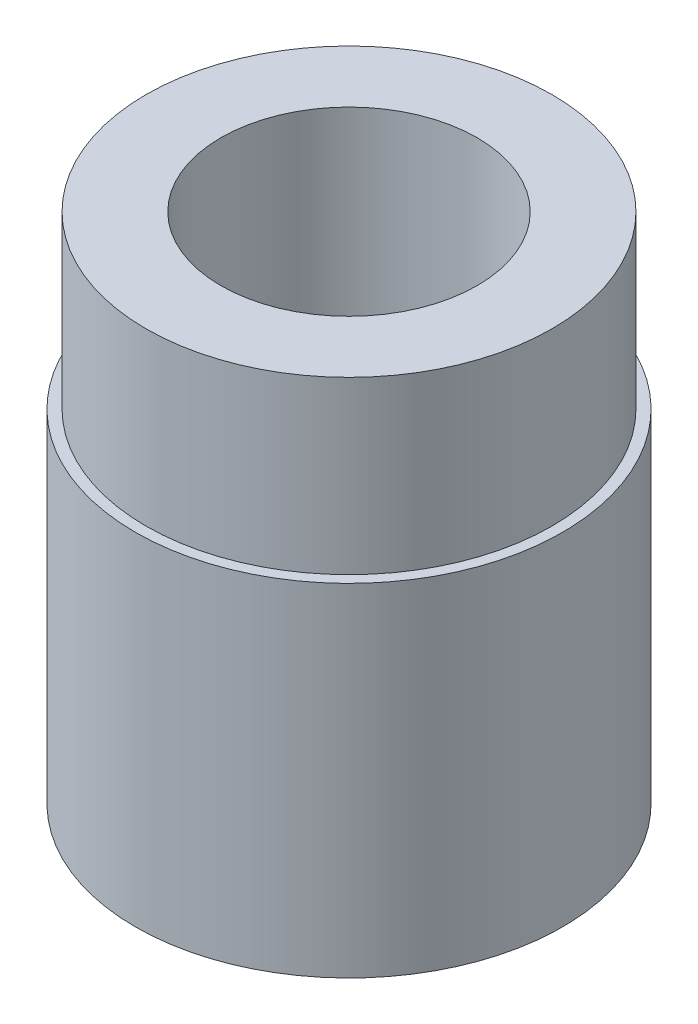
ISO-10303-21;
HEADER;
FILE_DESCRIPTION(('STEP AP214'),'2;1');
FILE_NAME('part.step','',(''),(''),'','','');
FILE_SCHEMA(('AUTOMOTIVE_DESIGN { 1 0 10303 214 1 1 1 1 }'));
ENDSEC;
DATA;
#1=APPLICATION_CONTEXT('core data for automotive mechanical design processes');
#2=APPLICATION_PROTOCOL_DEFINITION('international standard','automotive_design',2000,#1);
#3=PRODUCT_CONTEXT('',#1,'mechanical');
#4=PRODUCT('Part','Part','',(#3));
#5=PRODUCT_RELATED_PRODUCT_CATEGORY('part','',(#4));
#6=PRODUCT_DEFINITION_FORMATION('','',#4);
#7=PRODUCT_DEFINITION_CONTEXT('part definition',#1,'design');
#8=PRODUCT_DEFINITION('design','',#6,#7);
#9=PRODUCT_DEFINITION_SHAPE('','',#8);
#10=(LENGTH_UNIT() NAMED_UNIT(*) SI_UNIT(.MILLI.,.METRE.));
#11=(NAMED_UNIT(*) PLANE_ANGLE_UNIT() SI_UNIT($,.RADIAN.));
#12=(NAMED_UNIT(*) SI_UNIT($,.STERADIAN.) SOLID_ANGLE_UNIT());
#13=UNCERTAINTY_MEASURE_WITH_UNIT(LENGTH_MEASURE(1.E-05),#10,'distance_accuracy_value','');
#14=(GEOMETRIC_REPRESENTATION_CONTEXT(3) GLOBAL_UNCERTAINTY_ASSIGNED_CONTEXT((#13)) GLOBAL_UNIT_ASSIGNED_CONTEXT((#10,
#11,#12)) REPRESENTATION_CONTEXT('',''));
#15=CARTESIAN_POINT('',(0.,0.,0.));
#16=DIRECTION('',(0.,0.,1.));
#17=DIRECTION('',(1.,0.,0.));
#18=AXIS2_PLACEMENT_3D('',#15,#16,#17);
#19=CARTESIAN_POINT('',(0.,76.2,0.));
#20=DIRECTION('',(0.,1.,0.));
#21=DIRECTION('',(0.,0.,1.));
#22=AXIS2_PLACEMENT_3D('',#19,#20,#21);
#23=PLANE('',#22);
#24=CARTESIAN_POINT('',(0.,76.2,0.));
#25=DIRECTION('',(0.,1.,0.));
#26=DIRECTION('',(0.,0.,1.));
#27=AXIS2_PLACEMENT_3D('',#24,#25,#26);
#28=CIRCLE('',#27,19.05);
#29=CARTESIAN_POINT('',(0.,76.2,19.05));
#30=VERTEX_POINT('',#29);
#31=EDGE_CURVE('E40',#30,#30,#28,.T.);
#32=ORIENTED_EDGE('',*,*,#31,.F.);
#33=EDGE_LOOP('',(#32));
#34=FACE_BOUND('',#33,.T.);
#35=CARTESIAN_POINT('',(0.,76.2,0.));
#36=DIRECTION('',(0.,1.,0.));
#37=DIRECTION('',(0.,0.,1.));
#38=AXIS2_PLACEMENT_3D('',#35,#36,#37);
#39=CIRCLE('',#38,30.1625);
#40=CARTESIAN_POINT('',(0.,76.2,30.1625));
#41=VERTEX_POINT('',#40);
#42=EDGE_CURVE('E54',#41,#41,#39,.T.);
#43=ORIENTED_EDGE('',*,*,#42,.T.);
#44=EDGE_LOOP('',(#43));
#45=FACE_BOUND('',#44,.T.);
#46=ADVANCED_FACE('F33',(#34,#45),#23,.T.);
#47=CARTESIAN_POINT('',(0.,76.2,0.));
#48=DIRECTION('',(0.,-1.,0.));
#49=DIRECTION('',(0.,0.,-1.));
#50=AXIS2_PLACEMENT_3D('',#47,#48,#49);
#51=CYLINDRICAL_SURFACE('',#50,31.75);
#52=CARTESIAN_POINT('',(0.,0.,0.));
#53=DIRECTION('',(0.,1.,0.));
#54=DIRECTION('',(0.,0.,1.));
#55=AXIS2_PLACEMENT_3D('',#52,#53,#54);
#56=CIRCLE('',#55,31.75);
#57=CARTESIAN_POINT('',(0.,0.,31.75));
#58=VERTEX_POINT('',#57);
#59=EDGE_CURVE('E10',#58,#58,#56,.T.);
#60=ORIENTED_EDGE('',*,*,#59,.T.);
#61=EDGE_LOOP('',(#60));
#62=FACE_BOUND('',#61,.T.);
#63=CARTESIAN_POINT('',(0.,50.8,0.));
#64=DIRECTION('',(0.,1.,0.));
#65=DIRECTION('',(0.,0.,1.));
#66=AXIS2_PLACEMENT_3D('',#63,#64,#65);
#67=CIRCLE('',#66,31.75);
#68=CARTESIAN_POINT('',(0.,50.8,31.75));
#69=VERTEX_POINT('',#68);
#70=EDGE_CURVE('E49',#69,#69,#67,.T.);
#71=ORIENTED_EDGE('',*,*,#70,.F.);
#72=EDGE_LOOP('',(#71));
#73=FACE_BOUND('',#72,.T.);
#74=ADVANCED_FACE('F35',(#62,#73),#51,.T.);
#75=CARTESIAN_POINT('',(0.,0.,0.));
#76=DIRECTION('',(0.,1.,0.));
#77=DIRECTION('',(0.,0.,1.));
#78=AXIS2_PLACEMENT_3D('',#75,#76,#77);
#79=PLANE('',#78);
#80=ORIENTED_EDGE('',*,*,#59,.F.);
#81=EDGE_LOOP('',(#80));
#82=FACE_BOUND('',#81,.T.);
#83=CARTESIAN_POINT('',(0.,0.,0.));
#84=DIRECTION('',(0.,1.,0.));
#85=DIRECTION('',(0.,0.,1.));
#86=AXIS2_PLACEMENT_3D('',#83,#84,#85);
#87=CIRCLE('',#86,19.05);
#88=CARTESIAN_POINT('',(0.,0.,19.05));
#89=VERTEX_POINT('',#88);
#90=EDGE_CURVE('E44',#89,#89,#87,.T.);
#91=ORIENTED_EDGE('',*,*,#90,.T.);
#92=EDGE_LOOP('',(#91));
#93=FACE_BOUND('',#92,.T.);
#94=ADVANCED_FACE('F71',(#82,#93),#79,.F.);
#95=CARTESIAN_POINT('',(0.,76.2,0.));
#96=DIRECTION('',(0.,-1.,0.));
#97=DIRECTION('',(0.,0.,-1.));
#98=AXIS2_PLACEMENT_3D('',#95,#96,#97);
#99=CYLINDRICAL_SURFACE('',#98,19.05);
#100=ORIENTED_EDGE('',*,*,#31,.T.);
#101=EDGE_LOOP('',(#100));
#102=FACE_BOUND('',#101,.T.);
#103=ORIENTED_EDGE('',*,*,#90,.F.);
#104=EDGE_LOOP('',(#103));
#105=FACE_BOUND('',#104,.T.);
#106=ADVANCED_FACE('F66',(#102,#105),#99,.F.);
#107=CARTESIAN_POINT('',(0.,50.8,0.));
#108=DIRECTION('',(0.,1.,0.));
#109=DIRECTION('',(0.,0.,1.));
#110=AXIS2_PLACEMENT_3D('',#107,#108,#109);
#111=PLANE('',#110);
#112=CARTESIAN_POINT('',(0.,50.8,0.));
#113=DIRECTION('',(0.,1.,0.));
#114=DIRECTION('',(0.,0.,1.));
#115=AXIS2_PLACEMENT_3D('',#112,#113,#114);
#116=CIRCLE('',#115,30.1625);
#117=CARTESIAN_POINT('',(0.,50.8,30.1625));
#118=VERTEX_POINT('',#117);
#119=EDGE_CURVE('E53',#118,#118,#116,.T.);
#120=ORIENTED_EDGE('',*,*,#119,.F.);
#121=EDGE_LOOP('',(#120));
#122=FACE_BOUND('',#121,.T.);
#123=ORIENTED_EDGE('',*,*,#70,.T.);
#124=EDGE_LOOP('',(#123));
#125=FACE_BOUND('',#124,.T.);
#126=ADVANCED_FACE('F63',(#122,#125),#111,.T.);
#127=CARTESIAN_POINT('',(0.,50.8,0.));
#128=DIRECTION('',(0.,1.,0.));
#129=DIRECTION('',(0.,0.,1.));
#130=AXIS2_PLACEMENT_3D('',#127,#128,#129);
#131=CYLINDRICAL_SURFACE('',#130,30.1625);
#132=ORIENTED_EDGE('',*,*,#119,.T.);
#133=EDGE_LOOP('',(#132));
#134=FACE_BOUND('',#133,.T.);
#135=ORIENTED_EDGE('',*,*,#42,.F.);
#136=EDGE_LOOP('',(#135));
#137=FACE_BOUND('',#136,.T.);
#138=ADVANCED_FACE('F60',(#134,#137),#131,.T.);
#139=CLOSED_SHELL('',(#46,#74,#94,#106,#126,#138));
#140=MANIFOLD_SOLID_BREP('B2',#139);
#141=ADVANCED_BREP_SHAPE_REPRESENTATION('',(#18,#140),#14);
#142=SHAPE_DEFINITION_REPRESENTATION(#9,#141);
ENDSEC;
END-ISO-10303-21;
